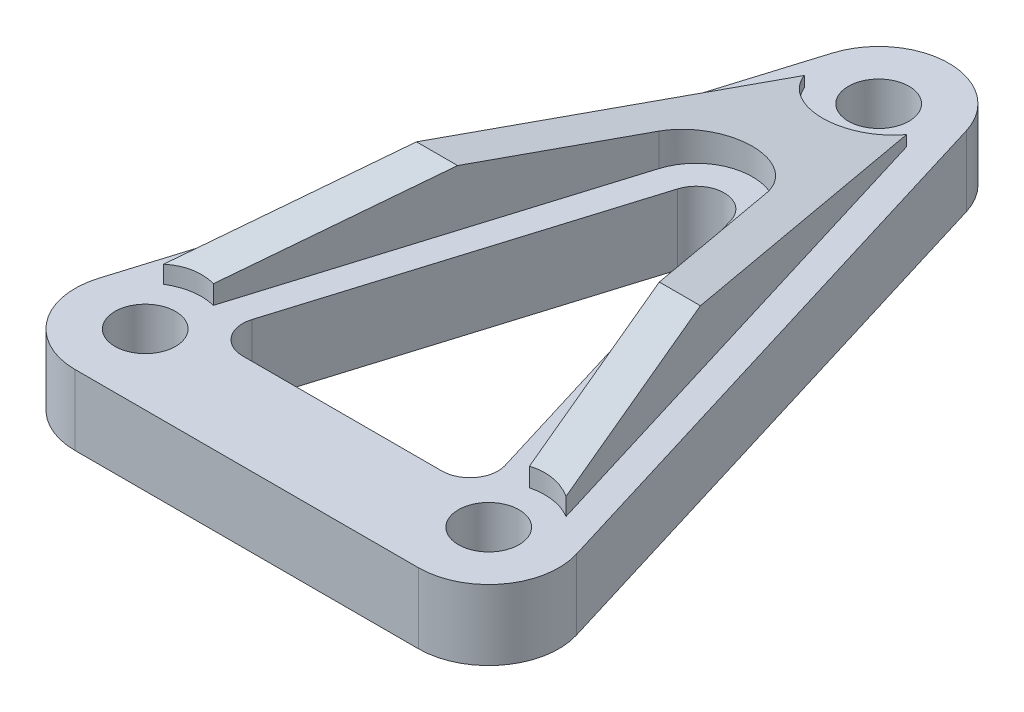
ISO-10303-21;
HEADER;
FILE_DESCRIPTION(('STEP AP214'),'2;1');
FILE_NAME('part.step','',(''),(''),'','','');
FILE_SCHEMA(('AUTOMOTIVE_DESIGN { 1 0 10303 214 1 1 1 1 }'));
ENDSEC;
DATA;
#1=APPLICATION_CONTEXT('core data for automotive mechanical design processes');
#2=APPLICATION_PROTOCOL_DEFINITION('international standard','automotive_design',2000,#1);
#3=PRODUCT_CONTEXT('',#1,'mechanical');
#4=PRODUCT('Part','Part','',(#3));
#5=PRODUCT_RELATED_PRODUCT_CATEGORY('part','',(#4));
#6=PRODUCT_DEFINITION_FORMATION('','',#4);
#7=PRODUCT_DEFINITION_CONTEXT('part definition',#1,'design');
#8=PRODUCT_DEFINITION('design','',#6,#7);
#9=PRODUCT_DEFINITION_SHAPE('','',#8);
#10=(LENGTH_UNIT() NAMED_UNIT(*) SI_UNIT(.MILLI.,.METRE.));
#11=(NAMED_UNIT(*) PLANE_ANGLE_UNIT() SI_UNIT($,.RADIAN.));
#12=(NAMED_UNIT(*) SI_UNIT($,.STERADIAN.) SOLID_ANGLE_UNIT());
#13=UNCERTAINTY_MEASURE_WITH_UNIT(LENGTH_MEASURE(1.E-05),#10,'distance_accuracy_value','');
#14=(GEOMETRIC_REPRESENTATION_CONTEXT(3) GLOBAL_UNCERTAINTY_ASSIGNED_CONTEXT((#13)) GLOBAL_UNIT_ASSIGNED_CONTEXT((#10,
#11,#12)) REPRESENTATION_CONTEXT('',''));
#15=CARTESIAN_POINT('',(0.,0.,0.));
#16=DIRECTION('',(0.,0.,1.));
#17=DIRECTION('',(1.,0.,0.));
#18=AXIS2_PLACEMENT_3D('',#15,#16,#17);
#19=CARTESIAN_POINT('',(0.,1.5875,0.));
#20=DIRECTION('',(0.,-1.,0.));
#21=DIRECTION('',(0.,0.,-1.));
#22=AXIS2_PLACEMENT_3D('',#19,#20,#21);
#23=PLANE('',#22);
#24=DIRECTION('',(-0.292371704722738,0.,0.956304755963035));
#25=VECTOR('',#24,1.);
#26=CARTESIAN_POINT('',(-0.121450704007307,1.5875,-0.0371312064997881));
#27=LINE('',#26,#25);
#28=CARTESIAN_POINT('',(-2.42901408014611,1.5875,7.51056850466189));
#29=VERTEX_POINT('',#28);
#30=CARTESIAN_POINT('',(-7.14531474412551,1.5875,22.9368928809973));
#31=VERTEX_POINT('',#30);
#32=EDGE_CURVE('E195',#29,#31,#27,.T.);
#33=ORIENTED_EDGE('',*,*,#32,.T.);
#34=CARTESIAN_POINT('',(-7.76555930905,1.5875,25.4));
#35=DIRECTION('',(0.,-1.,0.));
#36=DIRECTION('',(0.,0.,-1.));
#37=AXIS2_PLACEMENT_3D('',#34,#35,#36);
#38=CIRCLE('',#37,2.54);
#39=CARTESIAN_POINT('',(-9.09612017776847,1.5875,23.236390105718));
#40=VERTEX_POINT('',#39);
#41=EDGE_CURVE('E181',#40,#31,#38,.T.);
#42=ORIENTED_EDGE('',*,*,#41,.F.);
#43=DIRECTION('',(-0.292371704722738,0.,0.956304755963035));
#44=VECTOR('',#43,1.);
#45=CARTESIAN_POINT('',(-1.82176056010958,1.5875,-0.556968097496816));
#46=LINE('',#45,#44);
#47=CARTESIAN_POINT('',(-2.3129602515007,1.5875,1.04967369928842));
#48=VERTEX_POINT('',#47);
#49=EDGE_CURVE('E204',#48,#40,#46,.T.);
#50=ORIENTED_EDGE('',*,*,#49,.F.);
#51=CARTESIAN_POINT('',(0.,1.5875,0.));
#52=DIRECTION('',(0.,-1.,0.));
#53=DIRECTION('',(0.,0.,-1.));
#54=AXIS2_PLACEMENT_3D('',#51,#52,#53);
#55=CIRCLE('',#54,2.54);
#56=CARTESIAN_POINT('',(2.3129602515007,1.5875,1.04967369928842));
#57=VERTEX_POINT('',#56);
#58=EDGE_CURVE('E597',#57,#48,#55,.T.);
#59=ORIENTED_EDGE('',*,*,#58,.F.);
#60=DIRECTION('',(-0.292371704722738,0.,-0.956304755963035));
#61=VECTOR('',#60,1.);
#62=CARTESIAN_POINT('',(1.82176056010958,1.5875,-0.556968097496816));
#63=LINE('',#62,#61);
#64=CARTESIAN_POINT('',(9.09612017776848,1.5875,23.236390105718));
#65=VERTEX_POINT('',#64);
#66=EDGE_CURVE('E208',#65,#57,#63,.T.);
#67=ORIENTED_EDGE('',*,*,#66,.F.);
#68=CARTESIAN_POINT('',(7.76555930905001,1.5875,25.4));
#69=DIRECTION('',(0.,-1.,0.));
#70=DIRECTION('',(0.,0.,-1.));
#71=AXIS2_PLACEMENT_3D('',#68,#69,#70);
#72=CIRCLE('',#71,2.54);
#73=CARTESIAN_POINT('',(7.14531474412551,1.5875,22.9368928809973));
#74=VERTEX_POINT('',#73);
#75=EDGE_CURVE('E596',#74,#65,#72,.T.);
#76=ORIENTED_EDGE('',*,*,#75,.F.);
#77=DIRECTION('',(-0.292371704722738,0.,-0.956304755963035));
#78=VECTOR('',#77,1.);
#79=CARTESIAN_POINT('',(0.121450704007305,1.5875,-0.0371312064997876));
#80=LINE('',#79,#78);
#81=CARTESIAN_POINT('',(2.42901408014611,1.5875,7.51056850466189));
#82=VERTEX_POINT('',#81);
#83=EDGE_CURVE('E476',#74,#82,#80,.T.);
#84=ORIENTED_EDGE('',*,*,#83,.T.);
#85=CARTESIAN_POINT('',(0.,1.5875,8.25319263465764));
#86=DIRECTION('',(0.,1.,0.));
#87=DIRECTION('',(0.,0.,1.));
#88=AXIS2_PLACEMENT_3D('',#85,#86,#87);
#89=CIRCLE('',#88,2.54);
#90=EDGE_CURVE('E202',#82,#29,#89,.T.);
#91=ORIENTED_EDGE('',*,*,#90,.T.);
#92=EDGE_LOOP('',(#33,#42,#50,#59,#67,#76,#84,#91));
#93=FACE_BOUND('',#92,.T.);
#94=CARTESIAN_POINT('',(7.76555930905001,1.5875,25.4));
#95=DIRECTION('',(0.,1.,0.));
#96=DIRECTION('',(0.,0.,-1.));
#97=AXIS2_PLACEMENT_3D('',#94,#95,#96);
#98=CIRCLE('',#97,3.175);
#99=CARTESIAN_POINT('',(7.76555930905001,1.5875,28.575));
#100=VERTEX_POINT('',#99);
#101=CARTESIAN_POINT('',(10.8018269092326,1.5875,24.4717198375053));
#102=VERTEX_POINT('',#101);
#103=EDGE_CURVE('E288',#100,#102,#98,.T.);
#104=ORIENTED_EDGE('',*,*,#103,.T.);
#105=DIRECTION('',(-0.292371704722738,0.,-0.956304755963035));
#106=VECTOR('',#105,1.);
#107=CARTESIAN_POINT('',(3.03626760018264,1.5875,-0.928280162494693));
#108=LINE('',#107,#106);
#109=CARTESIAN_POINT('',(3.03626760018264,1.5875,-0.928280162494693));
#110=VERTEX_POINT('',#109);
#111=EDGE_CURVE('E290',#102,#110,#108,.T.);
#112=ORIENTED_EDGE('',*,*,#111,.T.);
#113=CARTESIAN_POINT('',(0.,1.5875,0.));
#114=DIRECTION('',(0.,1.,0.));
#115=DIRECTION('',(0.,0.,-1.));
#116=AXIS2_PLACEMENT_3D('',#113,#114,#115);
#117=CIRCLE('',#116,3.175);
#118=CARTESIAN_POINT('',(-3.03626760018264,1.5875,-0.928280162494693));
#119=VERTEX_POINT('',#118);
#120=EDGE_CURVE('E279',#110,#119,#117,.T.);
#121=ORIENTED_EDGE('',*,*,#120,.T.);
#122=DIRECTION('',(-0.292371704722738,0.,0.956304755963035));
#123=VECTOR('',#122,1.);
#124=CARTESIAN_POINT('',(-3.03626760018264,1.5875,-0.928280162494693));
#125=LINE('',#124,#123);
#126=CARTESIAN_POINT('',(-10.8018269092326,1.5875,24.4717198375053));
#127=VERTEX_POINT('',#126);
#128=EDGE_CURVE('E281',#119,#127,#125,.T.);
#129=ORIENTED_EDGE('',*,*,#128,.T.);
#130=CARTESIAN_POINT('',(-7.76555930905,1.5875,25.4));
#131=DIRECTION('',(0.,1.,0.));
#132=DIRECTION('',(0.,0.,1.));
#133=AXIS2_PLACEMENT_3D('',#130,#131,#132);
#134=CIRCLE('',#133,3.175);
#135=CARTESIAN_POINT('',(-7.76555930905,1.5875,28.575));
#136=VERTEX_POINT('',#135);
#137=EDGE_CURVE('E284',#127,#136,#134,.T.);
#138=ORIENTED_EDGE('',*,*,#137,.T.);
#139=DIRECTION('',(1.,0.,0.));
#140=VECTOR('',#139,1.);
#141=CARTESIAN_POINT('',(7.76555930905001,1.5875,28.575));
#142=LINE('',#141,#140);
#143=EDGE_CURVE('E286',#136,#100,#142,.T.);
#144=ORIENTED_EDGE('',*,*,#143,.T.);
#145=EDGE_LOOP('',(#104,#112,#121,#129,#138,#144));
#146=FACE_BOUND('',#145,.T.);
#147=CARTESIAN_POINT('',(4.50457696628677,1.5875,22.987));
#148=DIRECTION('',(0.,1.,0.));
#149=DIRECTION('',(0.,0.,1.));
#150=AXIS2_PLACEMENT_3D('',#147,#148,#149);
#151=CIRCLE('',#150,1.27);
#152=CARTESIAN_POINT('',(4.50457696628677,1.5875,24.257));
#153=VERTEX_POINT('',#152);
#154=CARTESIAN_POINT('',(5.71908400635983,1.5875,22.6156879350021));
#155=VERTEX_POINT('',#154);
#156=EDGE_CURVE('E223',#153,#155,#151,.T.);
#157=ORIENTED_EDGE('',*,*,#156,.F.);
#158=DIRECTION('',(1.,0.,0.));
#159=VECTOR('',#158,1.);
#160=CARTESIAN_POINT('',(4.50457696628677,1.5875,24.257));
#161=LINE('',#160,#159);
#162=CARTESIAN_POINT('',(-4.50457696628676,1.5875,24.257));
#163=VERTEX_POINT('',#162);
#164=EDGE_CURVE('E235',#163,#153,#161,.T.);
#165=ORIENTED_EDGE('',*,*,#164,.F.);
#166=CARTESIAN_POINT('',(-4.50457696628676,1.5875,22.987));
#167=DIRECTION('',(0.,1.,0.));
#168=DIRECTION('',(0.,0.,1.));
#169=AXIS2_PLACEMENT_3D('',#166,#167,#168);
#170=CIRCLE('',#169,1.27);
#171=CARTESIAN_POINT('',(-5.71908400635982,1.5875,22.6156879350021));
#172=VERTEX_POINT('',#171);
#173=EDGE_CURVE('E232',#172,#163,#170,.T.);
#174=ORIENTED_EDGE('',*,*,#173,.F.);
#175=DIRECTION('',(-0.292371704722738,0.,0.956304755963035));
#176=VECTOR('',#175,1.);
#177=CARTESIAN_POINT('',(-1.21450704007305,1.5875,7.88188056965976));
#178=LINE('',#177,#176);
#179=CARTESIAN_POINT('',(-1.21450704007305,1.5875,7.88188056965976));
#180=VERTEX_POINT('',#179);
#181=EDGE_CURVE('E230',#180,#172,#178,.T.);
#182=ORIENTED_EDGE('',*,*,#181,.F.);
#183=CARTESIAN_POINT('',(0.,1.5875,8.25319263465764));
#184=DIRECTION('',(0.,1.,0.));
#185=DIRECTION('',(0.,0.,1.));
#186=AXIS2_PLACEMENT_3D('',#183,#184,#185);
#187=CIRCLE('',#186,1.27);
#188=CARTESIAN_POINT('',(1.21450704007306,1.5875,7.88188056965976));
#189=VERTEX_POINT('',#188);
#190=EDGE_CURVE('E228',#189,#180,#187,.T.);
#191=ORIENTED_EDGE('',*,*,#190,.F.);
#192=DIRECTION('',(-0.292371704722738,0.,-0.956304755963035));
#193=VECTOR('',#192,1.);
#194=CARTESIAN_POINT('',(1.21450704007306,1.5875,7.88188056965976));
#195=LINE('',#194,#193);
#196=EDGE_CURVE('E225',#155,#189,#195,.T.);
#197=ORIENTED_EDGE('',*,*,#196,.F.);
#198=EDGE_LOOP('',(#157,#165,#174,#182,#191,#197));
#199=FACE_BOUND('',#198,.T.);
#200=CARTESIAN_POINT('',(0.,1.5875,0.));
#201=DIRECTION('',(0.,-1.,0.));
#202=DIRECTION('',(0.,0.,-1.));
#203=AXIS2_PLACEMENT_3D('',#200,#201,#202);
#204=CIRCLE('',#203,1.3716);
#205=CARTESIAN_POINT('',(0.,1.5875,-1.3716));
#206=VERTEX_POINT('',#205);
#207=EDGE_CURVE('E389',#206,#206,#204,.T.);
#208=ORIENTED_EDGE('',*,*,#207,.T.);
#209=EDGE_LOOP('',(#208));
#210=FACE_BOUND('',#209,.T.);
#211=CARTESIAN_POINT('',(7.76555930905001,1.5875,25.4));
#212=DIRECTION('',(0.,1.,0.));
#213=DIRECTION('',(0.,0.,1.));
#214=AXIS2_PLACEMENT_3D('',#211,#212,#213);
#215=CIRCLE('',#214,1.3716);
#216=CARTESIAN_POINT('',(7.76555930905001,1.5875,26.7716));
#217=VERTEX_POINT('',#216);
#218=EDGE_CURVE('E270',#217,#217,#215,.T.);
#219=ORIENTED_EDGE('',*,*,#218,.F.);
#220=EDGE_LOOP('',(#219));
#221=FACE_BOUND('',#220,.T.);
#222=CARTESIAN_POINT('',(-7.76555930905,1.5875,25.4));
#223=DIRECTION('',(0.,1.,0.));
#224=DIRECTION('',(0.,0.,1.));
#225=AXIS2_PLACEMENT_3D('',#222,#223,#224);
#226=CIRCLE('',#225,1.3716);
#227=CARTESIAN_POINT('',(-7.76555930905,1.5875,26.7716));
#228=VERTEX_POINT('',#227);
#229=EDGE_CURVE('E274',#228,#228,#226,.T.);
#230=ORIENTED_EDGE('',*,*,#229,.F.);
#231=EDGE_LOOP('',(#230));
#232=FACE_BOUND('',#231,.T.);
#233=ADVANCED_FACE('F35',(#93,#146,#199,#210,#221,#232),#23,.F.);
#234=CARTESIAN_POINT('',(0.,-1.5875,0.));
#235=DIRECTION('',(0.,-1.,0.));
#236=DIRECTION('',(0.,0.,-1.));
#237=AXIS2_PLACEMENT_3D('',#234,#235,#236);
#238=PLANE('',#237);
#239=CARTESIAN_POINT('',(-7.76555930905,-1.5875,25.4));
#240=DIRECTION('',(0.,1.,0.));
#241=DIRECTION('',(0.,0.,1.));
#242=AXIS2_PLACEMENT_3D('',#239,#240,#241);
#243=CIRCLE('',#242,1.3716);
#244=CARTESIAN_POINT('',(-7.76555930905,-1.5875,26.7716));
#245=VERTEX_POINT('',#244);
#246=EDGE_CURVE('E271',#245,#245,#243,.T.);
#247=ORIENTED_EDGE('',*,*,#246,.T.);
#248=EDGE_LOOP('',(#247));
#249=FACE_BOUND('',#248,.T.);
#250=CARTESIAN_POINT('',(0.,-1.5875,0.));
#251=DIRECTION('',(0.,1.,0.));
#252=DIRECTION('',(0.,0.,-1.));
#253=AXIS2_PLACEMENT_3D('',#250,#251,#252);
#254=CIRCLE('',#253,3.175);
#255=CARTESIAN_POINT('',(3.03626760018264,-1.5875,-0.928280162494693));
#256=VERTEX_POINT('',#255);
#257=CARTESIAN_POINT('',(-3.03626760018264,-1.5875,-0.928280162494693));
#258=VERTEX_POINT('',#257);
#259=EDGE_CURVE('E278',#256,#258,#254,.T.);
#260=ORIENTED_EDGE('',*,*,#259,.F.);
#261=DIRECTION('',(-0.292371704722738,0.,-0.956304755963035));
#262=VECTOR('',#261,1.);
#263=CARTESIAN_POINT('',(3.03626760018264,-1.5875,-0.928280162494693));
#264=LINE('',#263,#262);
#265=CARTESIAN_POINT('',(10.8018269092326,-1.5875,24.4717198375053));
#266=VERTEX_POINT('',#265);
#267=EDGE_CURVE('E282',#266,#256,#264,.T.);
#268=ORIENTED_EDGE('',*,*,#267,.F.);
#269=CARTESIAN_POINT('',(7.76555930905001,-1.5875,25.4));
#270=DIRECTION('',(0.,1.,0.));
#271=DIRECTION('',(0.,0.,-1.));
#272=AXIS2_PLACEMENT_3D('',#269,#270,#271);
#273=CIRCLE('',#272,3.175);
#274=CARTESIAN_POINT('',(7.76555930905001,-1.5875,28.575));
#275=VERTEX_POINT('',#274);
#276=EDGE_CURVE('E301',#275,#266,#273,.T.);
#277=ORIENTED_EDGE('',*,*,#276,.F.);
#278=DIRECTION('',(1.,0.,0.));
#279=VECTOR('',#278,1.);
#280=CARTESIAN_POINT('',(7.76555930905001,-1.5875,28.575));
#281=LINE('',#280,#279);
#282=CARTESIAN_POINT('',(-7.76555930905,-1.5875,28.575));
#283=VERTEX_POINT('',#282);
#284=EDGE_CURVE('E299',#283,#275,#281,.T.);
#285=ORIENTED_EDGE('',*,*,#284,.F.);
#286=CARTESIAN_POINT('',(-7.76555930905,-1.5875,25.4));
#287=DIRECTION('',(0.,1.,0.));
#288=DIRECTION('',(0.,0.,1.));
#289=AXIS2_PLACEMENT_3D('',#286,#287,#288);
#290=CIRCLE('',#289,3.175);
#291=CARTESIAN_POINT('',(-10.8018269092326,-1.5875,24.4717198375053));
#292=VERTEX_POINT('',#291);
#293=EDGE_CURVE('E297',#292,#283,#290,.T.);
#294=ORIENTED_EDGE('',*,*,#293,.F.);
#295=DIRECTION('',(-0.292371704722738,0.,0.956304755963035));
#296=VECTOR('',#295,1.);
#297=CARTESIAN_POINT('',(-3.03626760018264,-1.5875,-0.928280162494693));
#298=LINE('',#297,#296);
#299=EDGE_CURVE('E295',#258,#292,#298,.T.);
#300=ORIENTED_EDGE('',*,*,#299,.F.);
#301=EDGE_LOOP('',(#260,#268,#277,#285,#294,#300));
#302=FACE_BOUND('',#301,.T.);
#303=CARTESIAN_POINT('',(0.,-1.5875,0.));
#304=DIRECTION('',(0.,1.,0.));
#305=DIRECTION('',(0.,0.,1.));
#306=AXIS2_PLACEMENT_3D('',#303,#304,#305);
#307=CIRCLE('',#306,1.3716);
#308=CARTESIAN_POINT('',(0.,-1.5875,1.3716));
#309=VERTEX_POINT('',#308);
#310=EDGE_CURVE('E275',#309,#309,#307,.T.);
#311=ORIENTED_EDGE('',*,*,#310,.T.);
#312=EDGE_LOOP('',(#311));
#313=FACE_BOUND('',#312,.T.);
#314=CARTESIAN_POINT('',(7.76555930905001,-1.5875,25.4));
#315=DIRECTION('',(0.,1.,0.));
#316=DIRECTION('',(0.,0.,1.));
#317=AXIS2_PLACEMENT_3D('',#314,#315,#316);
#318=CIRCLE('',#317,1.3716);
#319=CARTESIAN_POINT('',(7.76555930905001,-1.5875,26.7716));
#320=VERTEX_POINT('',#319);
#321=EDGE_CURVE('E267',#320,#320,#318,.T.);
#322=ORIENTED_EDGE('',*,*,#321,.T.);
#323=EDGE_LOOP('',(#322));
#324=FACE_BOUND('',#323,.T.);
#325=DIRECTION('',(1.,0.,0.));
#326=VECTOR('',#325,1.);
#327=CARTESIAN_POINT('',(4.50457696628677,-1.5875,24.257));
#328=LINE('',#327,#326);
#329=CARTESIAN_POINT('',(-4.50457696628676,-1.5875,24.257));
#330=VERTEX_POINT('',#329);
#331=CARTESIAN_POINT('',(4.50457696628677,-1.5875,24.257));
#332=VERTEX_POINT('',#331);
#333=EDGE_CURVE('E226',#330,#332,#328,.T.);
#334=ORIENTED_EDGE('',*,*,#333,.T.);
#335=CARTESIAN_POINT('',(4.50457696628677,-1.5875,22.987));
#336=DIRECTION('',(0.,1.,0.));
#337=DIRECTION('',(0.,0.,1.));
#338=AXIS2_PLACEMENT_3D('',#335,#336,#337);
#339=CIRCLE('',#338,1.27);
#340=CARTESIAN_POINT('',(5.71908400635983,-1.5875,22.6156879350021));
#341=VERTEX_POINT('',#340);
#342=EDGE_CURVE('E222',#332,#341,#339,.T.);
#343=ORIENTED_EDGE('',*,*,#342,.T.);
#344=DIRECTION('',(-0.292371704722738,0.,-0.956304755963035));
#345=VECTOR('',#344,1.);
#346=CARTESIAN_POINT('',(1.21450704007306,-1.5875,7.88188056965976));
#347=LINE('',#346,#345);
#348=CARTESIAN_POINT('',(1.21450704007306,-1.5875,7.88188056965976));
#349=VERTEX_POINT('',#348);
#350=EDGE_CURVE('E240',#341,#349,#347,.T.);
#351=ORIENTED_EDGE('',*,*,#350,.T.);
#352=CARTESIAN_POINT('',(0.,-1.5875,8.25319263465764));
#353=DIRECTION('',(0.,1.,0.));
#354=DIRECTION('',(0.,0.,1.));
#355=AXIS2_PLACEMENT_3D('',#352,#353,#354);
#356=CIRCLE('',#355,1.27);
#357=CARTESIAN_POINT('',(-1.21450704007305,-1.5875,7.88188056965976));
#358=VERTEX_POINT('',#357);
#359=EDGE_CURVE('E243',#349,#358,#356,.T.);
#360=ORIENTED_EDGE('',*,*,#359,.T.);
#361=DIRECTION('',(-0.292371704722738,0.,0.956304755963035));
#362=VECTOR('',#361,1.);
#363=CARTESIAN_POINT('',(-1.21450704007305,-1.5875,7.88188056965976));
#364=LINE('',#363,#362);
#365=CARTESIAN_POINT('',(-5.71908400635982,-1.5875,22.6156879350021));
#366=VERTEX_POINT('',#365);
#367=EDGE_CURVE('E246',#358,#366,#364,.T.);
#368=ORIENTED_EDGE('',*,*,#367,.T.);
#369=CARTESIAN_POINT('',(-4.50457696628676,-1.5875,22.987));
#370=DIRECTION('',(0.,1.,0.));
#371=DIRECTION('',(0.,0.,1.));
#372=AXIS2_PLACEMENT_3D('',#369,#370,#371);
#373=CIRCLE('',#372,1.27);
#374=EDGE_CURVE('E249',#366,#330,#373,.T.);
#375=ORIENTED_EDGE('',*,*,#374,.T.);
#376=EDGE_LOOP('',(#334,#343,#351,#360,#368,#375));
#377=FACE_BOUND('',#376,.T.);
#378=ADVANCED_FACE('F329',(#249,#302,#313,#324,#377),#238,.T.);
#379=CARTESIAN_POINT('',(0.,1.5875,0.));
#380=DIRECTION('',(0.,-1.,0.));
#381=DIRECTION('',(0.,0.,-1.));
#382=AXIS2_PLACEMENT_3D('',#379,#380,#381);
#383=CYLINDRICAL_SURFACE('',#382,3.175);
#384=ORIENTED_EDGE('',*,*,#259,.T.);
#385=DIRECTION('',(0.,-1.,0.));
#386=VECTOR('',#385,1.);
#387=CARTESIAN_POINT('',(-3.03626760018264,1.5875,-0.928280162494693));
#388=LINE('',#387,#386);
#389=EDGE_CURVE('E318',#119,#258,#388,.T.);
#390=ORIENTED_EDGE('',*,*,#389,.F.);
#391=ORIENTED_EDGE('',*,*,#120,.F.);
#392=DIRECTION('',(0.,-1.,0.));
#393=VECTOR('',#392,1.);
#394=CARTESIAN_POINT('',(3.03626760018264,1.5875,-0.928280162494693));
#395=LINE('',#394,#393);
#396=EDGE_CURVE('E292',#110,#256,#395,.T.);
#397=ORIENTED_EDGE('',*,*,#396,.T.);
#398=EDGE_LOOP('',(#384,#390,#391,#397));
#399=FACE_BOUND('',#398,.T.);
#400=ADVANCED_FACE('F37',(#399),#383,.T.);
#401=CARTESIAN_POINT('',(-3.03626760018264,1.5875,-0.928280162494693));
#402=DIRECTION('',(0.956304755963035,0.,0.292371704722738));
#403=DIRECTION('',(0.292371704722738,0.,-0.956304755963035));
#404=AXIS2_PLACEMENT_3D('',#401,#402,#403);
#405=PLANE('',#404);
#406=ORIENTED_EDGE('',*,*,#299,.T.);
#407=DIRECTION('',(0.,-1.,0.));
#408=VECTOR('',#407,1.);
#409=CARTESIAN_POINT('',(-10.8018269092326,1.5875,24.4717198375053));
#410=LINE('',#409,#408);
#411=EDGE_CURVE('E315',#127,#292,#410,.T.);
#412=ORIENTED_EDGE('',*,*,#411,.F.);
#413=ORIENTED_EDGE('',*,*,#128,.F.);
#414=ORIENTED_EDGE('',*,*,#389,.T.);
#415=EDGE_LOOP('',(#406,#412,#413,#414));
#416=FACE_BOUND('',#415,.T.);
#417=ADVANCED_FACE('F354',(#416),#405,.F.);
#418=CARTESIAN_POINT('',(-7.76555930905,1.5875,25.4));
#419=DIRECTION('',(0.,-1.,0.));
#420=DIRECTION('',(0.,0.,-1.));
#421=AXIS2_PLACEMENT_3D('',#418,#419,#420);
#422=CYLINDRICAL_SURFACE('',#421,3.175);
#423=ORIENTED_EDGE('',*,*,#293,.T.);
#424=DIRECTION('',(0.,-1.,0.));
#425=VECTOR('',#424,1.);
#426=CARTESIAN_POINT('',(-7.76555930905,1.5875,28.575));
#427=LINE('',#426,#425);
#428=EDGE_CURVE('E312',#136,#283,#427,.T.);
#429=ORIENTED_EDGE('',*,*,#428,.F.);
#430=ORIENTED_EDGE('',*,*,#137,.F.);
#431=ORIENTED_EDGE('',*,*,#411,.T.);
#432=EDGE_LOOP('',(#423,#429,#430,#431));
#433=FACE_BOUND('',#432,.T.);
#434=ADVANCED_FACE('F351',(#433),#422,.T.);
#435=CARTESIAN_POINT('',(7.76555930905001,1.5875,28.575));
#436=DIRECTION('',(0.,0.,-1.));
#437=DIRECTION('',(-1.,0.,0.));
#438=AXIS2_PLACEMENT_3D('',#435,#436,#437);
#439=PLANE('',#438);
#440=ORIENTED_EDGE('',*,*,#284,.T.);
#441=DIRECTION('',(0.,-1.,0.));
#442=VECTOR('',#441,1.);
#443=CARTESIAN_POINT('',(7.76555930905001,1.5875,28.575));
#444=LINE('',#443,#442);
#445=EDGE_CURVE('E309',#100,#275,#444,.T.);
#446=ORIENTED_EDGE('',*,*,#445,.F.);
#447=ORIENTED_EDGE('',*,*,#143,.F.);
#448=ORIENTED_EDGE('',*,*,#428,.T.);
#449=EDGE_LOOP('',(#440,#446,#447,#448));
#450=FACE_BOUND('',#449,.T.);
#451=ADVANCED_FACE('F347',(#450),#439,.F.);
#452=CARTESIAN_POINT('',(7.76555930905001,1.5875,25.4));
#453=DIRECTION('',(0.,-1.,0.));
#454=DIRECTION('',(0.,0.,-1.));
#455=AXIS2_PLACEMENT_3D('',#452,#453,#454);
#456=CYLINDRICAL_SURFACE('',#455,3.175);
#457=ORIENTED_EDGE('',*,*,#276,.T.);
#458=DIRECTION('',(0.,-1.,0.));
#459=VECTOR('',#458,1.);
#460=CARTESIAN_POINT('',(10.8018269092326,1.5875,24.4717198375053));
#461=LINE('',#460,#459);
#462=EDGE_CURVE('E306',#102,#266,#461,.T.);
#463=ORIENTED_EDGE('',*,*,#462,.F.);
#464=ORIENTED_EDGE('',*,*,#103,.F.);
#465=ORIENTED_EDGE('',*,*,#445,.T.);
#466=EDGE_LOOP('',(#457,#463,#464,#465));
#467=FACE_BOUND('',#466,.T.);
#468=ADVANCED_FACE('F343',(#467),#456,.T.);
#469=CARTESIAN_POINT('',(3.03626760018264,1.5875,-0.928280162494693));
#470=DIRECTION('',(-0.956304755963035,0.,0.292371704722738));
#471=DIRECTION('',(0.292371704722738,0.,0.956304755963035));
#472=AXIS2_PLACEMENT_3D('',#469,#470,#471);
#473=PLANE('',#472);
#474=ORIENTED_EDGE('',*,*,#267,.T.);
#475=ORIENTED_EDGE('',*,*,#396,.F.);
#476=ORIENTED_EDGE('',*,*,#111,.F.);
#477=ORIENTED_EDGE('',*,*,#462,.T.);
#478=EDGE_LOOP('',(#474,#475,#476,#477));
#479=FACE_BOUND('',#478,.T.);
#480=ADVANCED_FACE('F340',(#479),#473,.F.);
#481=CARTESIAN_POINT('',(0.,1.5875,0.));
#482=DIRECTION('',(0.,-1.,0.));
#483=DIRECTION('',(0.,0.,-1.));
#484=AXIS2_PLACEMENT_3D('',#481,#482,#483);
#485=CYLINDRICAL_SURFACE('',#484,1.3716);
#486=ORIENTED_EDGE('',*,*,#207,.F.);
#487=EDGE_LOOP('',(#486));
#488=FACE_BOUND('',#487,.T.);
#489=ORIENTED_EDGE('',*,*,#310,.F.);
#490=EDGE_LOOP('',(#489));
#491=FACE_BOUND('',#490,.T.);
#492=ADVANCED_FACE('F337',(#488,#491),#485,.F.);
#493=CARTESIAN_POINT('',(-7.76555930905,1.5875,25.4));
#494=DIRECTION('',(0.,-1.,0.));
#495=DIRECTION('',(0.,0.,-1.));
#496=AXIS2_PLACEMENT_3D('',#493,#494,#495);
#497=CYLINDRICAL_SURFACE('',#496,1.3716);
#498=ORIENTED_EDGE('',*,*,#229,.T.);
#499=EDGE_LOOP('',(#498));
#500=FACE_BOUND('',#499,.T.);
#501=ORIENTED_EDGE('',*,*,#246,.F.);
#502=EDGE_LOOP('',(#501));
#503=FACE_BOUND('',#502,.T.);
#504=ADVANCED_FACE('F325',(#500,#503),#497,.F.);
#505=CARTESIAN_POINT('',(7.76555930905001,1.5875,25.4));
#506=DIRECTION('',(0.,-1.,0.));
#507=DIRECTION('',(0.,0.,-1.));
#508=AXIS2_PLACEMENT_3D('',#505,#506,#507);
#509=CYLINDRICAL_SURFACE('',#508,1.3716);
#510=ORIENTED_EDGE('',*,*,#218,.T.);
#511=EDGE_LOOP('',(#510));
#512=FACE_BOUND('',#511,.T.);
#513=ORIENTED_EDGE('',*,*,#321,.F.);
#514=EDGE_LOOP('',(#513));
#515=FACE_BOUND('',#514,.T.);
#516=ADVANCED_FACE('F392',(#512,#515),#509,.F.);
#517=CARTESIAN_POINT('',(4.50457696628677,1.5875,22.987));
#518=DIRECTION('',(0.,-1.,0.));
#519=DIRECTION('',(0.,0.,-1.));
#520=AXIS2_PLACEMENT_3D('',#517,#518,#519);
#521=CYLINDRICAL_SURFACE('',#520,1.27);
#522=ORIENTED_EDGE('',*,*,#342,.F.);
#523=DIRECTION('',(0.,-1.,0.));
#524=VECTOR('',#523,1.);
#525=CARTESIAN_POINT('',(4.50457696628677,1.5875,24.257));
#526=LINE('',#525,#524);
#527=EDGE_CURVE('E237',#153,#332,#526,.T.);
#528=ORIENTED_EDGE('',*,*,#527,.F.);
#529=ORIENTED_EDGE('',*,*,#156,.T.);
#530=DIRECTION('',(0.,-1.,0.));
#531=VECTOR('',#530,1.);
#532=CARTESIAN_POINT('',(5.71908400635983,1.5875,22.6156879350021));
#533=LINE('',#532,#531);
#534=EDGE_CURVE('E264',#155,#341,#533,.T.);
#535=ORIENTED_EDGE('',*,*,#534,.T.);
#536=EDGE_LOOP('',(#522,#528,#529,#535));
#537=FACE_BOUND('',#536,.T.);
#538=ADVANCED_FACE('F395',(#537),#521,.F.);
#539=CARTESIAN_POINT('',(1.21450704007306,1.5875,7.88188056965976));
#540=DIRECTION('',(-0.956304755963035,0.,0.292371704722738));
#541=DIRECTION('',(0.292371704722738,0.,0.956304755963035));
#542=AXIS2_PLACEMENT_3D('',#539,#540,#541);
#543=PLANE('',#542);
#544=ORIENTED_EDGE('',*,*,#350,.F.);
#545=ORIENTED_EDGE('',*,*,#534,.F.);
#546=ORIENTED_EDGE('',*,*,#196,.T.);
#547=DIRECTION('',(0.,-1.,0.));
#548=VECTOR('',#547,1.);
#549=CARTESIAN_POINT('',(1.21450704007306,1.5875,7.88188056965976));
#550=LINE('',#549,#548);
#551=EDGE_CURVE('E262',#189,#349,#550,.T.);
#552=ORIENTED_EDGE('',*,*,#551,.T.);
#553=EDGE_LOOP('',(#544,#545,#546,#552));
#554=FACE_BOUND('',#553,.T.);
#555=ADVANCED_FACE('F408',(#554),#543,.T.);
#556=CARTESIAN_POINT('',(0.,1.5875,8.25319263465764));
#557=DIRECTION('',(0.,-1.,0.));
#558=DIRECTION('',(0.,0.,-1.));
#559=AXIS2_PLACEMENT_3D('',#556,#557,#558);
#560=CYLINDRICAL_SURFACE('',#559,1.27);
#561=ORIENTED_EDGE('',*,*,#359,.F.);
#562=ORIENTED_EDGE('',*,*,#551,.F.);
#563=ORIENTED_EDGE('',*,*,#190,.T.);
#564=DIRECTION('',(0.,-1.,0.));
#565=VECTOR('',#564,1.);
#566=CARTESIAN_POINT('',(-1.21450704007305,1.5875,7.88188056965976));
#567=LINE('',#566,#565);
#568=EDGE_CURVE('E260',#180,#358,#567,.T.);
#569=ORIENTED_EDGE('',*,*,#568,.T.);
#570=EDGE_LOOP('',(#561,#562,#563,#569));
#571=FACE_BOUND('',#570,.T.);
#572=ADVANCED_FACE('F416',(#571),#560,.F.);
#573=CARTESIAN_POINT('',(-1.21450704007305,1.5875,7.88188056965976));
#574=DIRECTION('',(0.956304755963035,0.,0.292371704722738));
#575=DIRECTION('',(0.292371704722738,0.,-0.956304755963035));
#576=AXIS2_PLACEMENT_3D('',#573,#574,#575);
#577=PLANE('',#576);
#578=ORIENTED_EDGE('',*,*,#367,.F.);
#579=ORIENTED_EDGE('',*,*,#568,.F.);
#580=ORIENTED_EDGE('',*,*,#181,.T.);
#581=DIRECTION('',(0.,-1.,0.));
#582=VECTOR('',#581,1.);
#583=CARTESIAN_POINT('',(-5.71908400635982,1.5875,22.6156879350021));
#584=LINE('',#583,#582);
#585=EDGE_CURVE('E258',#172,#366,#584,.T.);
#586=ORIENTED_EDGE('',*,*,#585,.T.);
#587=EDGE_LOOP('',(#578,#579,#580,#586));
#588=FACE_BOUND('',#587,.T.);
#589=ADVANCED_FACE('F419',(#588),#577,.T.);
#590=CARTESIAN_POINT('',(-4.50457696628676,1.5875,22.987));
#591=DIRECTION('',(0.,-1.,0.));
#592=DIRECTION('',(0.,0.,-1.));
#593=AXIS2_PLACEMENT_3D('',#590,#591,#592);
#594=CYLINDRICAL_SURFACE('',#593,1.27);
#595=ORIENTED_EDGE('',*,*,#374,.F.);
#596=ORIENTED_EDGE('',*,*,#585,.F.);
#597=ORIENTED_EDGE('',*,*,#173,.T.);
#598=DIRECTION('',(0.,-1.,0.));
#599=VECTOR('',#598,1.);
#600=CARTESIAN_POINT('',(-4.50457696628676,1.5875,24.257));
#601=LINE('',#600,#599);
#602=EDGE_CURVE('E256',#163,#330,#601,.T.);
#603=ORIENTED_EDGE('',*,*,#602,.T.);
#604=EDGE_LOOP('',(#595,#596,#597,#603));
#605=FACE_BOUND('',#604,.T.);
#606=ADVANCED_FACE('F422',(#605),#594,.F.);
#607=CARTESIAN_POINT('',(4.50457696628677,1.5875,24.257));
#608=DIRECTION('',(0.,0.,-1.));
#609=DIRECTION('',(-1.,0.,0.));
#610=AXIS2_PLACEMENT_3D('',#607,#608,#609);
#611=PLANE('',#610);
#612=ORIENTED_EDGE('',*,*,#333,.F.);
#613=ORIENTED_EDGE('',*,*,#602,.F.);
#614=ORIENTED_EDGE('',*,*,#164,.T.);
#615=ORIENTED_EDGE('',*,*,#527,.T.);
#616=EDGE_LOOP('',(#612,#613,#614,#615));
#617=FACE_BOUND('',#616,.T.);
#618=ADVANCED_FACE('F403',(#617),#611,.T.);
#619=CARTESIAN_POINT('',(0.,4.7625,8.25319263465764));
#620=DIRECTION('',(0.,-1.,0.));
#621=DIRECTION('',(0.,0.,-1.));
#622=AXIS2_PLACEMENT_3D('',#619,#620,#621);
#623=CYLINDRICAL_SURFACE('',#622,2.54);
#624=CARTESIAN_POINT('',(0.,3.17072841875414,8.25319263465764));
#625=DIRECTION('',(0.,-0.988402388466209,0.151857559819372));
#626=DIRECTION('',(0.,-0.151857559819372,-0.988402388466209));
#627=AXIS2_PLACEMENT_3D('',#624,#625,#626);
#628=ELLIPSE('',#627,2.56980358368169,2.54);
#629=CARTESIAN_POINT('',(-2.42901408014611,3.05663208556018,7.51056850466189));
#630=VERTEX_POINT('',#629);
#631=CARTESIAN_POINT('',(2.42901408014611,3.05663208556018,7.51056850466189));
#632=VERTEX_POINT('',#631);
#633=EDGE_CURVE('E459',#630,#632,#628,.T.);
#634=ORIENTED_EDGE('',*,*,#633,.F.);
#635=DIRECTION('',(0.,-1.,0.));
#636=VECTOR('',#635,1.);
#637=CARTESIAN_POINT('',(-2.42901408014611,4.7625,7.51056850466189));
#638=LINE('',#637,#636);
#639=EDGE_CURVE('E203',#630,#29,#638,.T.);
#640=ORIENTED_EDGE('',*,*,#639,.T.);
#641=ORIENTED_EDGE('',*,*,#90,.F.);
#642=DIRECTION('',(0.,-1.,0.));
#643=VECTOR('',#642,1.);
#644=CARTESIAN_POINT('',(2.42901408014611,4.7625,7.51056850466189));
#645=LINE('',#644,#643);
#646=EDGE_CURVE('E206',#632,#82,#645,.T.);
#647=ORIENTED_EDGE('',*,*,#646,.F.);
#648=EDGE_LOOP('',(#634,#640,#641,#647));
#649=FACE_BOUND('',#648,.T.);
#650=ADVANCED_FACE('F429',(#649),#623,.F.);
#651=CARTESIAN_POINT('',(0.121450704007305,4.7625,-0.0371312064997876));
#652=DIRECTION('',(-0.956304755963035,0.,0.292371704722738));
#653=DIRECTION('',(0.292371704722738,0.,0.956304755963035));
#654=AXIS2_PLACEMENT_3D('',#651,#652,#653);
#655=PLANE('',#654);
#656=DIRECTION('',(0.,-1.,0.));
#657=VECTOR('',#656,1.);
#658=CARTESIAN_POINT('',(7.14531474412551,4.1275,22.9368928809973));
#659=LINE('',#658,#657);
#660=CARTESIAN_POINT('',(7.14531474412551,2.43623672152284,22.9368928809973));
#661=VERTEX_POINT('',#660);
#662=EDGE_CURVE('E595',#661,#74,#659,.T.);
#663=ORIENTED_EDGE('',*,*,#662,.F.);
#664=DIRECTION('',(0.287166496658825,-0.187855857507486,0.939279287537431));
#665=VECTOR('',#664,1.);
#666=CARTESIAN_POINT('',(0.243829238248271,6.95098510918859,0.363150942668526));
#667=LINE('',#666,#665);
#668=CARTESIAN_POINT('',(4.55995937085135,4.12749999999999,14.4805764886115));
#669=VERTEX_POINT('',#668);
#670=EDGE_CURVE('E473',#669,#661,#667,.T.);
#671=ORIENTED_EDGE('',*,*,#670,.F.);
#672=DIRECTION('',(0.289266141039379,0.145365453784303,0.94614691485745));
#673=VECTOR('',#672,1.);
#674=CARTESIAN_POINT('',(0.241942649706999,1.95755899735804,0.356980189598303));
#675=LINE('',#674,#673);
#676=EDGE_CURVE('E461',#632,#669,#675,.T.);
#677=ORIENTED_EDGE('',*,*,#676,.F.);
#678=ORIENTED_EDGE('',*,*,#646,.T.);
#679=ORIENTED_EDGE('',*,*,#83,.F.);
#680=EDGE_LOOP('',(#663,#671,#677,#678,#679));
#681=FACE_BOUND('',#680,.T.);
#682=ADVANCED_FACE('F499',(#681),#655,.T.);
#683=CARTESIAN_POINT('',(1.82176056010958,4.7625,-0.556968097496816));
#684=DIRECTION('',(-0.956304755963035,0.,0.292371704722738));
#685=DIRECTION('',(0.292371704722738,0.,0.956304755963035));
#686=AXIS2_PLACEMENT_3D('',#683,#684,#685);
#687=PLANE('',#686);
#688=DIRECTION('',(0.287166496658825,-0.187855857507486,0.939279287537431));
#689=VECTOR('',#688,1.);
#690=CARTESIAN_POINT('',(1.94974770901951,7.05128349699278,-0.138340996352445));
#691=LINE('',#690,#689);
#692=CARTESIAN_POINT('',(6.4191993138855,4.12749999999999,14.4805764886115));
#693=VERTEX_POINT('',#692);
#694=CARTESIAN_POINT('',(9.09612017776847,2.37633727657872,23.2363901057179));
#695=VERTEX_POINT('',#694);
#696=EDGE_CURVE('E470',#693,#695,#691,.T.);
#697=ORIENTED_EDGE('',*,*,#696,.T.);
#698=DIRECTION('',(0.,-1.,0.));
#699=VECTOR('',#698,1.);
#700=CARTESIAN_POINT('',(9.09612017776848,4.1275,23.236390105718));
#701=LINE('',#700,#699);
#702=EDGE_CURVE('E57',#695,#65,#701,.T.);
#703=ORIENTED_EDGE('',*,*,#702,.T.);
#704=ORIENTED_EDGE('',*,*,#66,.T.);
#705=DIRECTION('',(0.,-1.,0.));
#706=VECTOR('',#705,1.);
#707=CARTESIAN_POINT('',(2.3129602515007,4.1275,1.04967369928842));
#708=LINE('',#707,#706);
#709=CARTESIAN_POINT('',(2.3129602515007,2.06398401950665,1.04967369928842));
#710=VERTEX_POINT('',#709);
#711=EDGE_CURVE('E449',#57,#710,#708,.F.);
#712=ORIENTED_EDGE('',*,*,#711,.T.);
#713=DIRECTION('',(0.289266141039379,0.145365453784303,0.94614691485745));
#714=VECTOR('',#713,1.);
#715=CARTESIAN_POINT('',(1.94561087577766,1.87937925205102,-0.151871968193813));
#716=LINE('',#715,#714);
#717=EDGE_CURVE('E466',#710,#693,#716,.T.);
#718=ORIENTED_EDGE('',*,*,#717,.T.);
#719=EDGE_LOOP('',(#697,#703,#704,#712,#718));
#720=FACE_BOUND('',#719,.T.);
#721=ADVANCED_FACE('F505',(#720),#687,.F.);
#722=CARTESIAN_POINT('',(-1.82176056010958,4.7625,-0.556968097496816));
#723=DIRECTION('',(0.956304755963035,0.,0.292371704722738));
#724=DIRECTION('',(0.292371704722738,0.,-0.956304755963035));
#725=AXIS2_PLACEMENT_3D('',#722,#723,#724);
#726=PLANE('',#725);
#727=ORIENTED_EDGE('',*,*,#49,.T.);
#728=DIRECTION('',(0.,-1.,0.));
#729=VECTOR('',#728,1.);
#730=CARTESIAN_POINT('',(-9.09612017776847,4.1275,23.236390105718));
#731=LINE('',#730,#729);
#732=CARTESIAN_POINT('',(-9.09612017776847,2.37633727657871,23.2363901057179));
#733=VERTEX_POINT('',#732);
#734=EDGE_CURVE('E184',#40,#733,#731,.F.);
#735=ORIENTED_EDGE('',*,*,#734,.T.);
#736=DIRECTION('',(0.287166496658825,0.187855857507486,-0.939279287537431));
#737=VECTOR('',#736,1.);
#738=CARTESIAN_POINT('',(-1.94974770901951,7.05128349699278,-0.138340996352445));
#739=LINE('',#738,#737);
#740=CARTESIAN_POINT('',(-6.4191993138855,4.12749999999999,14.4805764886115));
#741=VERTEX_POINT('',#740);
#742=EDGE_CURVE('E468',#733,#741,#739,.T.);
#743=ORIENTED_EDGE('',*,*,#742,.T.);
#744=DIRECTION('',(0.289266141039378,-0.145365453784303,-0.94614691485745));
#745=VECTOR('',#744,1.);
#746=CARTESIAN_POINT('',(-1.94561087577766,1.87937925205102,-0.151871968193813));
#747=LINE('',#746,#745);
#748=CARTESIAN_POINT('',(-2.3129602515007,2.06398401950665,1.04967369928842));
#749=VERTEX_POINT('',#748);
#750=EDGE_CURVE('E463',#741,#749,#747,.T.);
#751=ORIENTED_EDGE('',*,*,#750,.T.);
#752=DIRECTION('',(0.,-1.,0.));
#753=VECTOR('',#752,1.);
#754=CARTESIAN_POINT('',(-2.3129602515007,4.1275,1.04967369928842));
#755=LINE('',#754,#753);
#756=EDGE_CURVE('E455',#749,#48,#755,.T.);
#757=ORIENTED_EDGE('',*,*,#756,.T.);
#758=EDGE_LOOP('',(#727,#735,#743,#751,#757));
#759=FACE_BOUND('',#758,.T.);
#760=ADVANCED_FACE('F509',(#759),#726,.F.);
#761=CARTESIAN_POINT('',(-0.121450704007307,4.7625,-0.0371312064997881));
#762=DIRECTION('',(0.956304755963035,0.,0.292371704722738));
#763=DIRECTION('',(0.292371704722738,0.,-0.956304755963035));
#764=AXIS2_PLACEMENT_3D('',#761,#762,#763);
#765=PLANE('',#764);
#766=DIRECTION('',(0.,-1.,0.));
#767=VECTOR('',#766,1.);
#768=CARTESIAN_POINT('',(-7.14531474412551,4.1275,22.9368928809973));
#769=LINE('',#768,#767);
#770=CARTESIAN_POINT('',(-7.1453147441255,2.43623672152284,22.9368928809973));
#771=VERTEX_POINT('',#770);
#772=EDGE_CURVE('E50',#31,#771,#769,.F.);
#773=ORIENTED_EDGE('',*,*,#772,.F.);
#774=ORIENTED_EDGE('',*,*,#32,.F.);
#775=ORIENTED_EDGE('',*,*,#639,.F.);
#776=DIRECTION('',(0.289266141039378,-0.145365453784303,-0.94614691485745));
#777=VECTOR('',#776,1.);
#778=CARTESIAN_POINT('',(-0.241942649707,1.95755899735804,0.356980189598303));
#779=LINE('',#778,#777);
#780=CARTESIAN_POINT('',(-4.55995937085134,4.12749999999999,14.4805764886115));
#781=VERTEX_POINT('',#780);
#782=EDGE_CURVE('E215',#781,#630,#779,.T.);
#783=ORIENTED_EDGE('',*,*,#782,.F.);
#784=DIRECTION('',(0.287166496658825,0.187855857507486,-0.939279287537431));
#785=VECTOR('',#784,1.);
#786=CARTESIAN_POINT('',(-0.243829238248273,6.95098510918859,0.363150942668526));
#787=LINE('',#786,#785);
#788=EDGE_CURVE('E198',#771,#781,#787,.T.);
#789=ORIENTED_EDGE('',*,*,#788,.F.);
#790=EDGE_LOOP('',(#773,#774,#775,#783,#789));
#791=FACE_BOUND('',#790,.T.);
#792=ADVANCED_FACE('F193',(#791),#765,.T.);
#793=CARTESIAN_POINT('',(-10.94055930905,1.5875,27.1805764886115));
#794=DIRECTION('',(0.,-0.98058067569092,-0.196116135138184));
#795=DIRECTION('',(0.,0.196116135138184,-0.98058067569092));
#796=AXIS2_PLACEMENT_3D('',#793,#794,#795);
#797=PLANE('',#796);
#798=ORIENTED_EDGE('',*,*,#670,.T.);
#799=CARTESIAN_POINT('',(7.76555930905001,1.94361529772231,25.4));
#800=DIRECTION('',(0.,-0.98058067569092,-0.196116135138184));
#801=DIRECTION('',(0.,-0.196116135138184,0.98058067569092));
#802=AXIS2_PLACEMENT_3D('',#799,#800,#801);
#803=ELLIPSE('',#802,2.59030191290513,2.54);
#804=EDGE_CURVE('E43',#661,#695,#803,.T.);
#805=ORIENTED_EDGE('',*,*,#804,.T.);
#806=ORIENTED_EDGE('',*,*,#696,.F.);
#807=DIRECTION('',(1.,0.,0.));
#808=VECTOR('',#807,1.);
#809=CARTESIAN_POINT('',(-10.94055930905,4.12749999999999,14.4805764886115));
#810=LINE('',#809,#808);
#811=EDGE_CURVE('E448',#669,#693,#810,.T.);
#812=ORIENTED_EDGE('',*,*,#811,.F.);
#813=EDGE_LOOP('',(#798,#805,#806,#812));
#814=FACE_BOUND('',#813,.T.);
#815=ADVANCED_FACE('F504',(#814),#797,.F.);
#816=ORIENTED_EDGE('',*,*,#742,.F.);
#817=CARTESIAN_POINT('',(-7.76555930905,1.94361529772231,25.4));
#818=DIRECTION('',(0.,-0.98058067569092,-0.196116135138184));
#819=DIRECTION('',(0.,-0.196116135138184,0.98058067569092));
#820=AXIS2_PLACEMENT_3D('',#817,#818,#819);
#821=ELLIPSE('',#820,2.59030191290513,2.54);
#822=EDGE_CURVE('E11',#733,#771,#821,.T.);
#823=ORIENTED_EDGE('',*,*,#822,.T.);
#824=ORIENTED_EDGE('',*,*,#788,.T.);
#825=EDGE_CURVE('E452',#741,#781,#810,.T.);
#826=ORIENTED_EDGE('',*,*,#825,.F.);
#827=EDGE_LOOP('',(#816,#823,#824,#826));
#828=FACE_BOUND('',#827,.T.);
#829=ADVANCED_FACE('F511',(#828),#797,.F.);
#830=CARTESIAN_POINT('',(-10.94055930905,4.12749999999999,14.4805764886115));
#831=DIRECTION('',(0.,-0.988402388466209,0.151857559819372));
#832=DIRECTION('',(0.,-0.151857559819372,-0.988402388466209));
#833=AXIS2_PLACEMENT_3D('',#830,#831,#832);
#834=PLANE('',#833);
#835=ORIENTED_EDGE('',*,*,#717,.F.);
#836=CARTESIAN_POINT('',(0.,1.90271277164183,0.));
#837=DIRECTION('',(0.,-0.988402388466209,0.151857559819372));
#838=DIRECTION('',(0.,-0.151857559819372,-0.988402388466209));
#839=AXIS2_PLACEMENT_3D('',#836,#837,#838);
#840=ELLIPSE('',#839,2.56980358368169,2.54);
#841=EDGE_CURVE('E484',#710,#749,#840,.T.);
#842=ORIENTED_EDGE('',*,*,#841,.T.);
#843=ORIENTED_EDGE('',*,*,#750,.F.);
#844=ORIENTED_EDGE('',*,*,#825,.T.);
#845=ORIENTED_EDGE('',*,*,#782,.T.);
#846=ORIENTED_EDGE('',*,*,#633,.T.);
#847=ORIENTED_EDGE('',*,*,#676,.T.);
#848=ORIENTED_EDGE('',*,*,#811,.T.);
#849=EDGE_LOOP('',(#835,#842,#843,#844,#845,#846,#847,#848));
#850=FACE_BOUND('',#849,.T.);
#851=ADVANCED_FACE('F492',(#850),#834,.F.);
#852=CARTESIAN_POINT('',(0.,4.1275,0.));
#853=DIRECTION('',(0.,-1.,0.));
#854=DIRECTION('',(0.,0.,-1.));
#855=AXIS2_PLACEMENT_3D('',#852,#853,#854);
#856=CYLINDRICAL_SURFACE('',#855,2.54);
#857=ORIENTED_EDGE('',*,*,#58,.T.);
#858=ORIENTED_EDGE('',*,*,#756,.F.);
#859=ORIENTED_EDGE('',*,*,#841,.F.);
#860=ORIENTED_EDGE('',*,*,#711,.F.);
#861=EDGE_LOOP('',(#857,#858,#859,#860));
#862=FACE_BOUND('',#861,.T.);
#863=ADVANCED_FACE('F518',(#862),#856,.F.);
#864=CARTESIAN_POINT('',(7.76555930905001,4.1275,25.4));
#865=DIRECTION('',(0.,-1.,0.));
#866=DIRECTION('',(0.,0.,-1.));
#867=AXIS2_PLACEMENT_3D('',#864,#865,#866);
#868=CYLINDRICAL_SURFACE('',#867,2.54);
#869=ORIENTED_EDGE('',*,*,#662,.T.);
#870=ORIENTED_EDGE('',*,*,#75,.T.);
#871=ORIENTED_EDGE('',*,*,#702,.F.);
#872=ORIENTED_EDGE('',*,*,#804,.F.);
#873=EDGE_LOOP('',(#869,#870,#871,#872));
#874=FACE_BOUND('',#873,.T.);
#875=ADVANCED_FACE('F576',(#874),#868,.F.);
#876=CARTESIAN_POINT('',(-7.76555930905,4.1275,25.4));
#877=DIRECTION('',(0.,-1.,0.));
#878=DIRECTION('',(0.,0.,-1.));
#879=AXIS2_PLACEMENT_3D('',#876,#877,#878);
#880=CYLINDRICAL_SURFACE('',#879,2.54);
#881=ORIENTED_EDGE('',*,*,#41,.T.);
#882=ORIENTED_EDGE('',*,*,#772,.T.);
#883=ORIENTED_EDGE('',*,*,#822,.F.);
#884=ORIENTED_EDGE('',*,*,#734,.F.);
#885=EDGE_LOOP('',(#881,#882,#883,#884));
#886=FACE_BOUND('',#885,.T.);
#887=ADVANCED_FACE('F182',(#886),#880,.F.);
#888=CLOSED_SHELL('',(#233,#378,#400,#417,#434,#451,#468,#480,#492,#504,#516,#538,#555,#572,
#589,#606,#618,#650,#682,#721,#760,#792,#815,#829,#851,#863,#875,#887));
#889=MANIFOLD_SOLID_BREP('B2',#888);
#890=ADVANCED_BREP_SHAPE_REPRESENTATION('',(#18,#889),#14);
#891=SHAPE_DEFINITION_REPRESENTATION(#9,#890);
ENDSEC;
END-ISO-10303-21;
